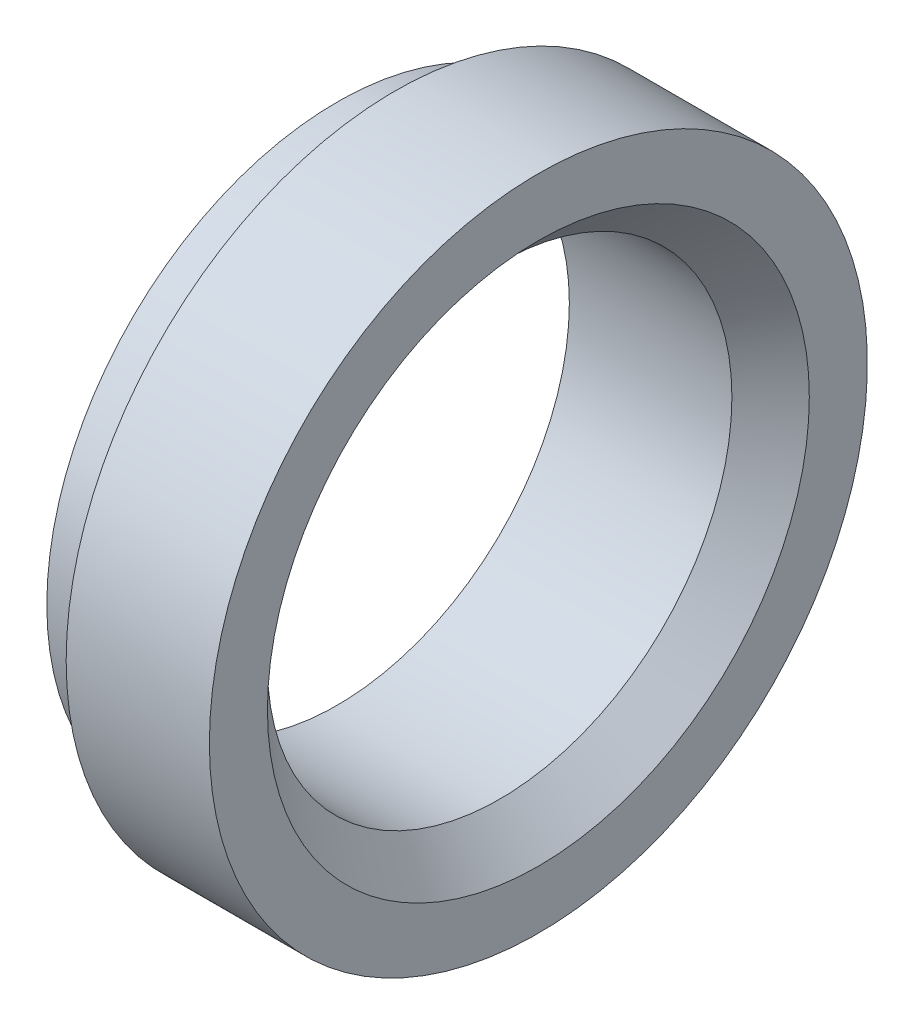
ISO-10303-21;
HEADER;
FILE_DESCRIPTION(('STEP AP214'),'2;1');
FILE_NAME('part.step','',(''),(''),'','','');
FILE_SCHEMA(('AUTOMOTIVE_DESIGN { 1 0 10303 214 1 1 1 1 }'));
ENDSEC;
DATA;
#1=APPLICATION_CONTEXT('core data for automotive mechanical design processes');
#2=APPLICATION_PROTOCOL_DEFINITION('international standard','automotive_design',2000,#1);
#3=PRODUCT_CONTEXT('',#1,'mechanical');
#4=PRODUCT('Part','Part','',(#3));
#5=PRODUCT_RELATED_PRODUCT_CATEGORY('part','',(#4));
#6=PRODUCT_DEFINITION_FORMATION('','',#4);
#7=PRODUCT_DEFINITION_CONTEXT('part definition',#1,'design');
#8=PRODUCT_DEFINITION('design','',#6,#7);
#9=PRODUCT_DEFINITION_SHAPE('','',#8);
#10=(LENGTH_UNIT() NAMED_UNIT(*) SI_UNIT(.MILLI.,.METRE.));
#11=(NAMED_UNIT(*) PLANE_ANGLE_UNIT() SI_UNIT($,.RADIAN.));
#12=(NAMED_UNIT(*) SI_UNIT($,.STERADIAN.) SOLID_ANGLE_UNIT());
#13=UNCERTAINTY_MEASURE_WITH_UNIT(LENGTH_MEASURE(1.E-05),#10,'distance_accuracy_value','');
#14=(GEOMETRIC_REPRESENTATION_CONTEXT(3) GLOBAL_UNCERTAINTY_ASSIGNED_CONTEXT((#13)) GLOBAL_UNIT_ASSIGNED_CONTEXT((#10,
#11,#12)) REPRESENTATION_CONTEXT('',''));
#15=CARTESIAN_POINT('',(0.,0.,0.));
#16=DIRECTION('',(0.,0.,1.));
#17=DIRECTION('',(1.,0.,0.));
#18=AXIS2_PLACEMENT_3D('',#15,#16,#17);
#19=CARTESIAN_POINT('',(0.,0.,0.));
#20=DIRECTION('',(-1.,0.,0.));
#21=DIRECTION('',(0.,0.,1.));
#22=AXIS2_PLACEMENT_3D('',#19,#20,#21);
#23=CYLINDRICAL_SURFACE('',#22,8.5);
#24=CARTESIAN_POINT('',(5.2,0.,0.));
#25=DIRECTION('',(-1.,0.,0.));
#26=DIRECTION('',(0.,0.,1.));
#27=AXIS2_PLACEMENT_3D('',#24,#25,#26);
#28=CIRCLE('',#27,8.5);
#29=CARTESIAN_POINT('',(5.2,0.,8.5));
#30=VERTEX_POINT('',#29);
#31=EDGE_CURVE('E49',#30,#30,#28,.T.);
#32=ORIENTED_EDGE('',*,*,#31,.T.);
#33=EDGE_LOOP('',(#32));
#34=FACE_BOUND('',#33,.T.);
#35=CARTESIAN_POINT('',(1.5,0.,0.));
#36=DIRECTION('',(-1.,0.,0.));
#37=DIRECTION('',(0.,0.,1.));
#38=AXIS2_PLACEMENT_3D('',#35,#36,#37);
#39=CIRCLE('',#38,8.5);
#40=CARTESIAN_POINT('',(1.5,0.,8.5));
#41=VERTEX_POINT('',#40);
#42=EDGE_CURVE('E10',#41,#41,#39,.T.);
#43=ORIENTED_EDGE('',*,*,#42,.F.);
#44=EDGE_LOOP('',(#43));
#45=FACE_BOUND('',#44,.T.);
#46=ADVANCED_FACE('F24',(#34,#45),#23,.T.);
#47=CARTESIAN_POINT('',(1.5,7.5,0.));
#48=DIRECTION('',(-1.,0.,0.));
#49=DIRECTION('',(0.,0.,1.));
#50=AXIS2_PLACEMENT_3D('',#47,#48,#49);
#51=PLANE('',#50);
#52=ORIENTED_EDGE('',*,*,#42,.T.);
#53=EDGE_LOOP('',(#52));
#54=FACE_BOUND('',#53,.T.);
#55=CARTESIAN_POINT('',(1.5,0.,0.));
#56=DIRECTION('',(-1.,0.,0.));
#57=DIRECTION('',(0.,0.,1.));
#58=AXIS2_PLACEMENT_3D('',#55,#56,#57);
#59=CIRCLE('',#58,7.5);
#60=CARTESIAN_POINT('',(1.5,0.,7.5));
#61=VERTEX_POINT('',#60);
#62=EDGE_CURVE('E30',#61,#61,#59,.T.);
#63=ORIENTED_EDGE('',*,*,#62,.F.);
#64=EDGE_LOOP('',(#63));
#65=FACE_BOUND('',#64,.T.);
#66=ADVANCED_FACE('F67',(#54,#65),#51,.T.);
#67=CARTESIAN_POINT('',(0.,0.,0.));
#68=DIRECTION('',(-1.,0.,0.));
#69=DIRECTION('',(0.,0.,1.));
#70=AXIS2_PLACEMENT_3D('',#67,#68,#69);
#71=CYLINDRICAL_SURFACE('',#70,7.5);
#72=ORIENTED_EDGE('',*,*,#62,.T.);
#73=EDGE_LOOP('',(#72));
#74=FACE_BOUND('',#73,.T.);
#75=CARTESIAN_POINT('',(0.,0.,0.));
#76=DIRECTION('',(-1.,0.,0.));
#77=DIRECTION('',(0.,0.,1.));
#78=AXIS2_PLACEMENT_3D('',#75,#76,#77);
#79=CIRCLE('',#78,7.5);
#80=CARTESIAN_POINT('',(0.,0.,7.5));
#81=VERTEX_POINT('',#80);
#82=EDGE_CURVE('E34',#81,#81,#79,.T.);
#83=ORIENTED_EDGE('',*,*,#82,.F.);
#84=EDGE_LOOP('',(#83));
#85=FACE_BOUND('',#84,.T.);
#86=ADVANCED_FACE('F71',(#74,#85),#71,.T.);
#87=CARTESIAN_POINT('',(0.,6.,0.));
#88=DIRECTION('',(-1.,0.,0.));
#89=DIRECTION('',(0.,0.,1.));
#90=AXIS2_PLACEMENT_3D('',#87,#88,#89);
#91=PLANE('',#90);
#92=ORIENTED_EDGE('',*,*,#82,.T.);
#93=EDGE_LOOP('',(#92));
#94=FACE_BOUND('',#93,.T.);
#95=CARTESIAN_POINT('',(0.,0.,0.));
#96=DIRECTION('',(-1.,0.,0.));
#97=DIRECTION('',(0.,0.,1.));
#98=AXIS2_PLACEMENT_3D('',#95,#96,#97);
#99=CIRCLE('',#98,6.);
#100=CARTESIAN_POINT('',(0.,0.,6.));
#101=VERTEX_POINT('',#100);
#102=EDGE_CURVE('E38',#101,#101,#99,.T.);
#103=ORIENTED_EDGE('',*,*,#102,.F.);
#104=EDGE_LOOP('',(#103));
#105=FACE_BOUND('',#104,.T.);
#106=ADVANCED_FACE('F75',(#94,#105),#91,.T.);
#107=CARTESIAN_POINT('',(0.,0.,0.));
#108=DIRECTION('',(-1.,0.,0.));
#109=DIRECTION('',(0.,0.,1.));
#110=AXIS2_PLACEMENT_3D('',#107,#108,#109);
#111=CYLINDRICAL_SURFACE('',#110,6.);
#112=ORIENTED_EDGE('',*,*,#102,.T.);
#113=EDGE_LOOP('',(#112));
#114=FACE_BOUND('',#113,.T.);
#115=CARTESIAN_POINT('',(4.2,0.,0.));
#116=DIRECTION('',(-1.,0.,0.));
#117=DIRECTION('',(0.,0.,1.));
#118=AXIS2_PLACEMENT_3D('',#115,#116,#117);
#119=CIRCLE('',#118,6.);
#120=CARTESIAN_POINT('',(4.2,0.,6.));
#121=VERTEX_POINT('',#120);
#122=EDGE_CURVE('E43',#121,#121,#119,.T.);
#123=ORIENTED_EDGE('',*,*,#122,.F.);
#124=EDGE_LOOP('',(#123));
#125=FACE_BOUND('',#124,.T.);
#126=ADVANCED_FACE('F63',(#114,#125),#111,.F.);
#127=CARTESIAN_POINT('',(4.2,0.,0.));
#128=DIRECTION('',(1.,0.,0.));
#129=DIRECTION('',(0.,0.,-1.));
#130=AXIS2_PLACEMENT_3D('',#127,#128,#129);
#131=CONICAL_SURFACE('',#130,6.,0.785398163397443);
#132=CARTESIAN_POINT('',(5.2,0.,0.));
#133=DIRECTION('',(-1.,0.,0.));
#134=DIRECTION('',(0.,0.,1.));
#135=AXIS2_PLACEMENT_3D('',#132,#133,#134);
#136=CIRCLE('',#135,6.99999999999999);
#137=CARTESIAN_POINT('',(5.2,0.,6.99999999999999));
#138=VERTEX_POINT('',#137);
#139=EDGE_CURVE('E46',#138,#138,#136,.T.);
#140=ORIENTED_EDGE('',*,*,#139,.F.);
#141=EDGE_LOOP('',(#140));
#142=FACE_BOUND('',#141,.T.);
#143=ORIENTED_EDGE('',*,*,#122,.T.);
#144=EDGE_LOOP('',(#143));
#145=FACE_BOUND('',#144,.T.);
#146=ADVANCED_FACE('F57',(#142,#145),#131,.F.);
#147=CARTESIAN_POINT('',(5.2,8.5,0.));
#148=DIRECTION('',(1.,0.,0.));
#149=DIRECTION('',(0.,0.,-1.));
#150=AXIS2_PLACEMENT_3D('',#147,#148,#149);
#151=PLANE('',#150);
#152=ORIENTED_EDGE('',*,*,#139,.T.);
#153=EDGE_LOOP('',(#152));
#154=FACE_BOUND('',#153,.T.);
#155=ORIENTED_EDGE('',*,*,#31,.F.);
#156=EDGE_LOOP('',(#155));
#157=FACE_BOUND('',#156,.T.);
#158=ADVANCED_FACE('F55',(#154,#157),#151,.T.);
#159=CLOSED_SHELL('',(#46,#66,#86,#106,#126,#146,#158));
#160=MANIFOLD_SOLID_BREP('B2',#159);
#161=ADVANCED_BREP_SHAPE_REPRESENTATION('',(#18,#160),#14);
#162=SHAPE_DEFINITION_REPRESENTATION(#9,#161);
ENDSEC;
END-ISO-10303-21;
